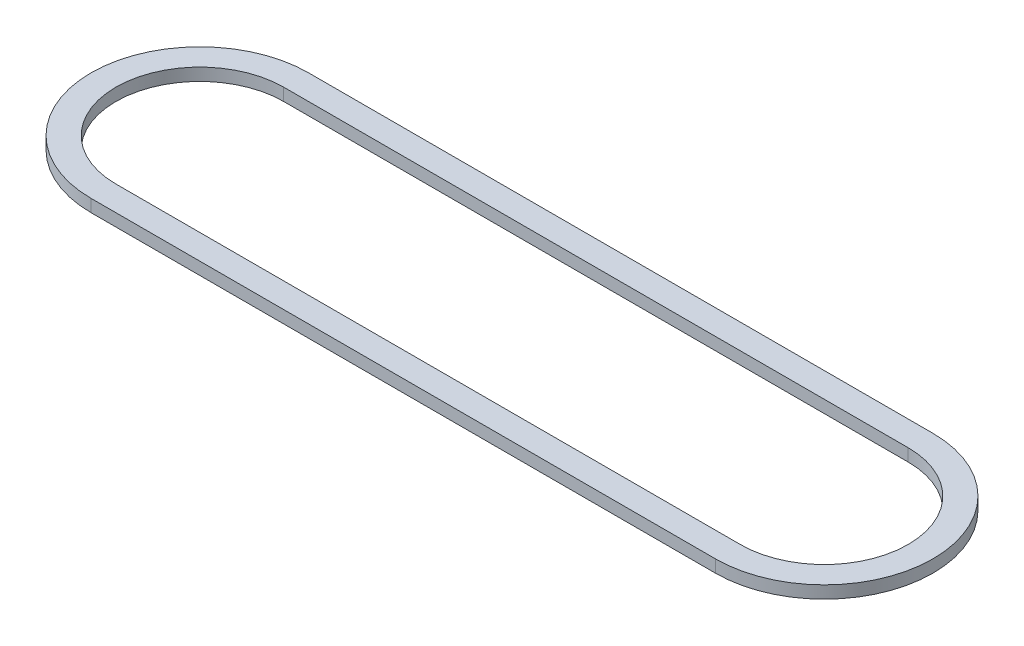
ISO-10303-21;
HEADER;
FILE_DESCRIPTION(('STEP AP214'),'2;1');
FILE_NAME('part.step','',(''),(''),'','','');
FILE_SCHEMA(('AUTOMOTIVE_DESIGN { 1 0 10303 214 1 1 1 1 }'));
ENDSEC;
DATA;
#1=APPLICATION_CONTEXT('core data for automotive mechanical design processes');
#2=APPLICATION_PROTOCOL_DEFINITION('international standard','automotive_design',2000,#1);
#3=PRODUCT_CONTEXT('',#1,'mechanical');
#4=PRODUCT('Part','Part','',(#3));
#5=PRODUCT_RELATED_PRODUCT_CATEGORY('part','',(#4));
#6=PRODUCT_DEFINITION_FORMATION('','',#4);
#7=PRODUCT_DEFINITION_CONTEXT('part definition',#1,'design');
#8=PRODUCT_DEFINITION('design','',#6,#7);
#9=PRODUCT_DEFINITION_SHAPE('','',#8);
#10=(LENGTH_UNIT() NAMED_UNIT(*) SI_UNIT(.MILLI.,.METRE.));
#11=(NAMED_UNIT(*) PLANE_ANGLE_UNIT() SI_UNIT($,.RADIAN.));
#12=(NAMED_UNIT(*) SI_UNIT($,.STERADIAN.) SOLID_ANGLE_UNIT());
#13=UNCERTAINTY_MEASURE_WITH_UNIT(LENGTH_MEASURE(1.E-05),#10,'distance_accuracy_value','');
#14=(GEOMETRIC_REPRESENTATION_CONTEXT(3) GLOBAL_UNCERTAINTY_ASSIGNED_CONTEXT((#13)) GLOBAL_UNIT_ASSIGNED_CONTEXT((#10,
#11,#12)) REPRESENTATION_CONTEXT('',''));
#15=CARTESIAN_POINT('',(0.,0.,0.));
#16=DIRECTION('',(0.,0.,1.));
#17=DIRECTION('',(1.,0.,0.));
#18=AXIS2_PLACEMENT_3D('',#15,#16,#17);
#19=CARTESIAN_POINT('',(-12.7635,0.508,0.));
#20=DIRECTION('',(0.,1.,0.));
#21=DIRECTION('',(0.,0.,1.));
#22=AXIS2_PLACEMENT_3D('',#19,#20,#21);
#23=PLANE('',#22);
#24=CARTESIAN_POINT('',(-12.7635,0.508,0.));
#25=DIRECTION('',(0.,1.,0.));
#26=DIRECTION('',(0.,0.,1.));
#27=AXIS2_PLACEMENT_3D('',#24,#25,#26);
#28=CIRCLE('',#27,4.445);
#29=CARTESIAN_POINT('',(-12.7635,0.508,-4.445));
#30=VERTEX_POINT('',#29);
#31=CARTESIAN_POINT('',(-12.7635,0.508,4.445));
#32=VERTEX_POINT('',#31);
#33=EDGE_CURVE('E133',#30,#32,#28,.T.);
#34=ORIENTED_EDGE('',*,*,#33,.T.);
#35=DIRECTION('',(1.,0.,0.));
#36=VECTOR('',#35,1.);
#37=CARTESIAN_POINT('',(-12.7635,0.508,4.445));
#38=LINE('',#37,#36);
#39=CARTESIAN_POINT('',(12.7635,0.508,4.445));
#40=VERTEX_POINT('',#39);
#41=EDGE_CURVE('E136',#32,#40,#38,.T.);
#42=ORIENTED_EDGE('',*,*,#41,.T.);
#43=CARTESIAN_POINT('',(12.7635,0.508,0.));
#44=DIRECTION('',(0.,1.,0.));
#45=DIRECTION('',(0.,0.,1.));
#46=AXIS2_PLACEMENT_3D('',#43,#44,#45);
#47=CIRCLE('',#46,4.445);
#48=CARTESIAN_POINT('',(12.7635,0.508,-4.44500000000001));
#49=VERTEX_POINT('',#48);
#50=EDGE_CURVE('E139',#40,#49,#47,.T.);
#51=ORIENTED_EDGE('',*,*,#50,.T.);
#52=DIRECTION('',(-1.,0.,0.));
#53=VECTOR('',#52,1.);
#54=CARTESIAN_POINT('',(-12.7635,0.508,-4.445));
#55=LINE('',#54,#53);
#56=EDGE_CURVE('E141',#49,#30,#55,.T.);
#57=ORIENTED_EDGE('',*,*,#56,.T.);
#58=EDGE_LOOP('',(#34,#42,#51,#57));
#59=FACE_BOUND('',#58,.T.);
#60=DIRECTION('',(1.,0.,0.));
#61=VECTOR('',#60,1.);
#62=CARTESIAN_POINT('',(-12.7635,0.508,3.429));
#63=LINE('',#62,#61);
#64=CARTESIAN_POINT('',(-12.7635,0.508,3.429));
#65=VERTEX_POINT('',#64);
#66=CARTESIAN_POINT('',(12.7635,0.508,3.429));
#67=VERTEX_POINT('',#66);
#68=EDGE_CURVE('E105',#65,#67,#63,.T.);
#69=ORIENTED_EDGE('',*,*,#68,.F.);
#70=CARTESIAN_POINT('',(-12.7635,0.508,0.));
#71=DIRECTION('',(0.,1.,0.));
#72=DIRECTION('',(0.,0.,1.));
#73=AXIS2_PLACEMENT_3D('',#70,#71,#72);
#74=CIRCLE('',#73,3.429);
#75=CARTESIAN_POINT('',(-12.7635,0.508,-3.429));
#76=VERTEX_POINT('',#75);
#77=EDGE_CURVE('E97',#76,#65,#74,.T.);
#78=ORIENTED_EDGE('',*,*,#77,.F.);
#79=DIRECTION('',(-1.,0.,0.));
#80=VECTOR('',#79,1.);
#81=CARTESIAN_POINT('',(-12.7635,0.508,-3.429));
#82=LINE('',#81,#80);
#83=CARTESIAN_POINT('',(12.7635,0.508,-3.42900000000001));
#84=VERTEX_POINT('',#83);
#85=EDGE_CURVE('E119',#84,#76,#82,.T.);
#86=ORIENTED_EDGE('',*,*,#85,.F.);
#87=CARTESIAN_POINT('',(12.7635,0.508,0.));
#88=DIRECTION('',(0.,1.,0.));
#89=DIRECTION('',(0.,0.,1.));
#90=AXIS2_PLACEMENT_3D('',#87,#88,#89);
#91=CIRCLE('',#90,3.429);
#92=EDGE_CURVE('E117',#67,#84,#91,.T.);
#93=ORIENTED_EDGE('',*,*,#92,.F.);
#94=EDGE_LOOP('',(#69,#78,#86,#93));
#95=FACE_BOUND('',#94,.T.);
#96=ADVANCED_FACE('F32',(#59,#95),#23,.T.);
#97=CARTESIAN_POINT('',(-12.7635,0.,0.));
#98=DIRECTION('',(0.,1.,0.));
#99=DIRECTION('',(0.,0.,1.));
#100=AXIS2_PLACEMENT_3D('',#97,#98,#99);
#101=PLANE('',#100);
#102=CARTESIAN_POINT('',(-12.7635,0.,0.));
#103=DIRECTION('',(0.,1.,0.));
#104=DIRECTION('',(0.,0.,1.));
#105=AXIS2_PLACEMENT_3D('',#102,#103,#104);
#106=CIRCLE('',#105,4.445);
#107=CARTESIAN_POINT('',(-12.7635,0.,-4.445));
#108=VERTEX_POINT('',#107);
#109=CARTESIAN_POINT('',(-12.7635,0.,4.445));
#110=VERTEX_POINT('',#109);
#111=EDGE_CURVE('E113',#108,#110,#106,.T.);
#112=ORIENTED_EDGE('',*,*,#111,.F.);
#113=DIRECTION('',(-1.,0.,0.));
#114=VECTOR('',#113,1.);
#115=CARTESIAN_POINT('',(-12.7635,0.,-4.445));
#116=LINE('',#115,#114);
#117=CARTESIAN_POINT('',(12.7635,0.,-4.44500000000001));
#118=VERTEX_POINT('',#117);
#119=EDGE_CURVE('E137',#118,#108,#116,.T.);
#120=ORIENTED_EDGE('',*,*,#119,.F.);
#121=CARTESIAN_POINT('',(12.7635,0.,0.));
#122=DIRECTION('',(0.,1.,0.));
#123=DIRECTION('',(0.,0.,1.));
#124=AXIS2_PLACEMENT_3D('',#121,#122,#123);
#125=CIRCLE('',#124,4.445);
#126=CARTESIAN_POINT('',(12.7635,0.,4.445));
#127=VERTEX_POINT('',#126);
#128=EDGE_CURVE('E148',#127,#118,#125,.T.);
#129=ORIENTED_EDGE('',*,*,#128,.F.);
#130=DIRECTION('',(1.,0.,0.));
#131=VECTOR('',#130,1.);
#132=CARTESIAN_POINT('',(-12.7635,0.,4.445));
#133=LINE('',#132,#131);
#134=EDGE_CURVE('E146',#110,#127,#133,.T.);
#135=ORIENTED_EDGE('',*,*,#134,.F.);
#136=EDGE_LOOP('',(#112,#120,#129,#135));
#137=FACE_BOUND('',#136,.T.);
#138=CARTESIAN_POINT('',(-12.7635,0.,0.));
#139=DIRECTION('',(0.,1.,0.));
#140=DIRECTION('',(0.,0.,1.));
#141=AXIS2_PLACEMENT_3D('',#138,#139,#140);
#142=CIRCLE('',#141,3.429);
#143=CARTESIAN_POINT('',(-12.7635,0.,-3.429));
#144=VERTEX_POINT('',#143);
#145=CARTESIAN_POINT('',(-12.7635,0.,3.429));
#146=VERTEX_POINT('',#145);
#147=EDGE_CURVE('E55',#144,#146,#142,.T.);
#148=ORIENTED_EDGE('',*,*,#147,.T.);
#149=DIRECTION('',(1.,0.,0.));
#150=VECTOR('',#149,1.);
#151=CARTESIAN_POINT('',(-12.7635,0.,3.429));
#152=LINE('',#151,#150);
#153=CARTESIAN_POINT('',(12.7635,0.,3.429));
#154=VERTEX_POINT('',#153);
#155=EDGE_CURVE('E112',#146,#154,#152,.T.);
#156=ORIENTED_EDGE('',*,*,#155,.T.);
#157=CARTESIAN_POINT('',(12.7635,0.,0.));
#158=DIRECTION('',(0.,1.,0.));
#159=DIRECTION('',(0.,0.,1.));
#160=AXIS2_PLACEMENT_3D('',#157,#158,#159);
#161=CIRCLE('',#160,3.429);
#162=CARTESIAN_POINT('',(12.7635,0.,-3.42900000000001));
#163=VERTEX_POINT('',#162);
#164=EDGE_CURVE('E125',#154,#163,#161,.T.);
#165=ORIENTED_EDGE('',*,*,#164,.T.);
#166=DIRECTION('',(-1.,0.,0.));
#167=VECTOR('',#166,1.);
#168=CARTESIAN_POINT('',(-12.7635,0.,-3.429));
#169=LINE('',#168,#167);
#170=EDGE_CURVE('E106',#163,#144,#169,.T.);
#171=ORIENTED_EDGE('',*,*,#170,.T.);
#172=EDGE_LOOP('',(#148,#156,#165,#171));
#173=FACE_BOUND('',#172,.T.);
#174=ADVANCED_FACE('F166',(#137,#173),#101,.F.);
#175=CARTESIAN_POINT('',(-12.7635,0.508,0.));
#176=DIRECTION('',(0.,-1.,0.));
#177=DIRECTION('',(0.,0.,-1.));
#178=AXIS2_PLACEMENT_3D('',#175,#176,#177);
#179=CYLINDRICAL_SURFACE('',#178,4.445);
#180=ORIENTED_EDGE('',*,*,#111,.T.);
#181=DIRECTION('',(0.,-1.,0.));
#182=VECTOR('',#181,1.);
#183=CARTESIAN_POINT('',(-12.7635,0.508,4.445));
#184=LINE('',#183,#182);
#185=EDGE_CURVE('E11',#32,#110,#184,.T.);
#186=ORIENTED_EDGE('',*,*,#185,.F.);
#187=ORIENTED_EDGE('',*,*,#33,.F.);
#188=DIRECTION('',(0.,-1.,0.));
#189=VECTOR('',#188,1.);
#190=CARTESIAN_POINT('',(-12.7635,0.508,-4.445));
#191=LINE('',#190,#189);
#192=EDGE_CURVE('E143',#30,#108,#191,.T.);
#193=ORIENTED_EDGE('',*,*,#192,.T.);
#194=EDGE_LOOP('',(#180,#186,#187,#193));
#195=FACE_BOUND('',#194,.T.);
#196=ADVANCED_FACE('F34',(#195),#179,.T.);
#197=CARTESIAN_POINT('',(-12.7635,0.508,4.445));
#198=DIRECTION('',(0.,0.,-1.));
#199=DIRECTION('',(-1.,0.,0.));
#200=AXIS2_PLACEMENT_3D('',#197,#198,#199);
#201=PLANE('',#200);
#202=ORIENTED_EDGE('',*,*,#134,.T.);
#203=DIRECTION('',(0.,-1.,0.));
#204=VECTOR('',#203,1.);
#205=CARTESIAN_POINT('',(12.7635,0.508,4.445));
#206=LINE('',#205,#204);
#207=EDGE_CURVE('E40',#40,#127,#206,.T.);
#208=ORIENTED_EDGE('',*,*,#207,.F.);
#209=ORIENTED_EDGE('',*,*,#41,.F.);
#210=ORIENTED_EDGE('',*,*,#185,.T.);
#211=EDGE_LOOP('',(#202,#208,#209,#210));
#212=FACE_BOUND('',#211,.T.);
#213=ADVANCED_FACE('F176',(#212),#201,.F.);
#214=CARTESIAN_POINT('',(12.7635,0.508,0.));
#215=DIRECTION('',(0.,-1.,0.));
#216=DIRECTION('',(0.,0.,-1.));
#217=AXIS2_PLACEMENT_3D('',#214,#215,#216);
#218=CYLINDRICAL_SURFACE('',#217,4.445);
#219=ORIENTED_EDGE('',*,*,#128,.T.);
#220=DIRECTION('',(0.,-1.,0.));
#221=VECTOR('',#220,1.);
#222=CARTESIAN_POINT('',(12.7635,0.508,-4.44500000000001));
#223=LINE('',#222,#221);
#224=EDGE_CURVE('E153',#49,#118,#223,.T.);
#225=ORIENTED_EDGE('',*,*,#224,.F.);
#226=ORIENTED_EDGE('',*,*,#50,.F.);
#227=ORIENTED_EDGE('',*,*,#207,.T.);
#228=EDGE_LOOP('',(#219,#225,#226,#227));
#229=FACE_BOUND('',#228,.T.);
#230=ADVANCED_FACE('F160',(#229),#218,.T.);
#231=CARTESIAN_POINT('',(-12.7635,0.508,-4.445));
#232=DIRECTION('',(0.,0.,1.));
#233=DIRECTION('',(1.,0.,0.));
#234=AXIS2_PLACEMENT_3D('',#231,#232,#233);
#235=PLANE('',#234);
#236=ORIENTED_EDGE('',*,*,#119,.T.);
#237=ORIENTED_EDGE('',*,*,#192,.F.);
#238=ORIENTED_EDGE('',*,*,#56,.F.);
#239=ORIENTED_EDGE('',*,*,#224,.T.);
#240=EDGE_LOOP('',(#236,#237,#238,#239));
#241=FACE_BOUND('',#240,.T.);
#242=ADVANCED_FACE('F170',(#241),#235,.F.);
#243=CARTESIAN_POINT('',(-12.7635,0.508,0.));
#244=DIRECTION('',(0.,-1.,0.));
#245=DIRECTION('',(0.,0.,-1.));
#246=AXIS2_PLACEMENT_3D('',#243,#244,#245);
#247=CYLINDRICAL_SURFACE('',#246,3.429);
#248=ORIENTED_EDGE('',*,*,#147,.F.);
#249=DIRECTION('',(0.,-1.,0.));
#250=VECTOR('',#249,1.);
#251=CARTESIAN_POINT('',(-12.7635,0.508,-3.429));
#252=LINE('',#251,#250);
#253=EDGE_CURVE('E101',#76,#144,#252,.T.);
#254=ORIENTED_EDGE('',*,*,#253,.F.);
#255=ORIENTED_EDGE('',*,*,#77,.T.);
#256=DIRECTION('',(0.,-1.,0.));
#257=VECTOR('',#256,1.);
#258=CARTESIAN_POINT('',(-12.7635,0.508,3.429));
#259=LINE('',#258,#257);
#260=EDGE_CURVE('E100',#65,#146,#259,.T.);
#261=ORIENTED_EDGE('',*,*,#260,.T.);
#262=EDGE_LOOP('',(#248,#254,#255,#261));
#263=FACE_BOUND('',#262,.T.);
#264=ADVANCED_FACE('F99',(#263),#247,.F.);
#265=CARTESIAN_POINT('',(-12.7635,0.508,3.429));
#266=DIRECTION('',(0.,0.,-1.));
#267=DIRECTION('',(-1.,0.,0.));
#268=AXIS2_PLACEMENT_3D('',#265,#266,#267);
#269=PLANE('',#268);
#270=ORIENTED_EDGE('',*,*,#155,.F.);
#271=ORIENTED_EDGE('',*,*,#260,.F.);
#272=ORIENTED_EDGE('',*,*,#68,.T.);
#273=DIRECTION('',(0.,-1.,0.));
#274=VECTOR('',#273,1.);
#275=CARTESIAN_POINT('',(12.7635,0.508,3.429));
#276=LINE('',#275,#274);
#277=EDGE_CURVE('E114',#67,#154,#276,.T.);
#278=ORIENTED_EDGE('',*,*,#277,.T.);
#279=EDGE_LOOP('',(#270,#271,#272,#278));
#280=FACE_BOUND('',#279,.T.);
#281=ADVANCED_FACE('F109',(#280),#269,.T.);
#282=CARTESIAN_POINT('',(12.7635,0.508,0.));
#283=DIRECTION('',(0.,-1.,0.));
#284=DIRECTION('',(0.,0.,-1.));
#285=AXIS2_PLACEMENT_3D('',#282,#283,#284);
#286=CYLINDRICAL_SURFACE('',#285,3.429);
#287=ORIENTED_EDGE('',*,*,#164,.F.);
#288=ORIENTED_EDGE('',*,*,#277,.F.);
#289=ORIENTED_EDGE('',*,*,#92,.T.);
#290=DIRECTION('',(0.,-1.,0.));
#291=VECTOR('',#290,1.);
#292=CARTESIAN_POINT('',(12.7635,0.508,-3.42900000000001));
#293=LINE('',#292,#291);
#294=EDGE_CURVE('E47',#84,#163,#293,.T.);
#295=ORIENTED_EDGE('',*,*,#294,.T.);
#296=EDGE_LOOP('',(#287,#288,#289,#295));
#297=FACE_BOUND('',#296,.T.);
#298=ADVANCED_FACE('F199',(#297),#286,.F.);
#299=CARTESIAN_POINT('',(-12.7635,0.508,-3.429));
#300=DIRECTION('',(0.,0.,1.));
#301=DIRECTION('',(1.,0.,0.));
#302=AXIS2_PLACEMENT_3D('',#299,#300,#301);
#303=PLANE('',#302);
#304=ORIENTED_EDGE('',*,*,#170,.F.);
#305=ORIENTED_EDGE('',*,*,#294,.F.);
#306=ORIENTED_EDGE('',*,*,#85,.T.);
#307=ORIENTED_EDGE('',*,*,#253,.T.);
#308=EDGE_LOOP('',(#304,#305,#306,#307));
#309=FACE_BOUND('',#308,.T.);
#310=ADVANCED_FACE('F203',(#309),#303,.T.);
#311=CLOSED_SHELL('',(#96,#174,#196,#213,#230,#242,#264,#281,#298,#310));
#312=MANIFOLD_SOLID_BREP('B2',#311);
#313=ADVANCED_BREP_SHAPE_REPRESENTATION('',(#18,#312),#14);
#314=SHAPE_DEFINITION_REPRESENTATION(#9,#313);
ENDSEC;
END-ISO-10303-21;
